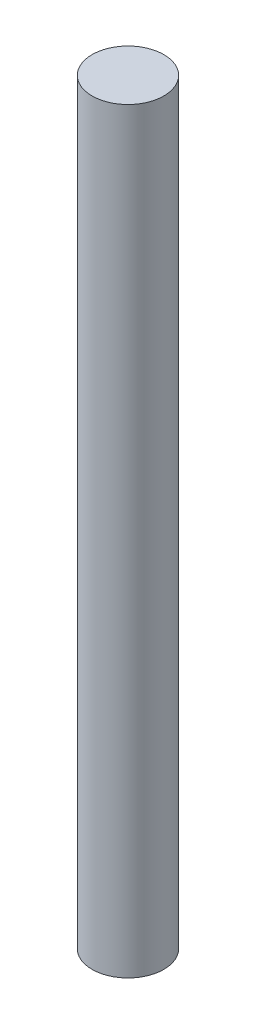
ISO-10303-21;
HEADER;
FILE_DESCRIPTION(('STEP AP214'),'2;1');
FILE_NAME('part.step','',(''),(''),'','','');
FILE_SCHEMA(('AUTOMOTIVE_DESIGN { 1 0 10303 214 1 1 1 1 }'));
ENDSEC;
DATA;
#1=APPLICATION_CONTEXT('core data for automotive mechanical design processes');
#2=APPLICATION_PROTOCOL_DEFINITION('international standard','automotive_design',2000,#1);
#3=PRODUCT_CONTEXT('',#1,'mechanical');
#4=PRODUCT('Part','Part','',(#3));
#5=PRODUCT_RELATED_PRODUCT_CATEGORY('part','',(#4));
#6=PRODUCT_DEFINITION_FORMATION('','',#4);
#7=PRODUCT_DEFINITION_CONTEXT('part definition',#1,'design');
#8=PRODUCT_DEFINITION('design','',#6,#7);
#9=PRODUCT_DEFINITION_SHAPE('','',#8);
#10=(LENGTH_UNIT() NAMED_UNIT(*) SI_UNIT(.MILLI.,.METRE.));
#11=(NAMED_UNIT(*) PLANE_ANGLE_UNIT() SI_UNIT($,.RADIAN.));
#12=(NAMED_UNIT(*) SI_UNIT($,.STERADIAN.) SOLID_ANGLE_UNIT());
#13=UNCERTAINTY_MEASURE_WITH_UNIT(LENGTH_MEASURE(1.E-05),#10,'distance_accuracy_value','');
#14=(GEOMETRIC_REPRESENTATION_CONTEXT(3) GLOBAL_UNCERTAINTY_ASSIGNED_CONTEXT((#13)) GLOBAL_UNIT_ASSIGNED_CONTEXT((#10,
#11,#12)) REPRESENTATION_CONTEXT('',''));
#15=CARTESIAN_POINT('',(0.,0.,0.));
#16=DIRECTION('',(0.,0.,1.));
#17=DIRECTION('',(1.,0.,0.));
#18=AXIS2_PLACEMENT_3D('',#15,#16,#17);
#19=CARTESIAN_POINT('',(0.,71.,0.));
#20=DIRECTION('',(0.,-1.,0.));
#21=DIRECTION('',(0.,0.,-1.));
#22=AXIS2_PLACEMENT_3D('',#19,#20,#21);
#23=CYLINDRICAL_SURFACE('',#22,3.3655);
#24=CARTESIAN_POINT('',(0.,71.,0.));
#25=DIRECTION('',(0.,1.,0.));
#26=DIRECTION('',(0.,0.,1.));
#27=AXIS2_PLACEMENT_3D('',#24,#25,#26);
#28=CIRCLE('',#27,3.3655);
#29=CARTESIAN_POINT('',(0.,71.,3.3655));
#30=VERTEX_POINT('',#29);
#31=EDGE_CURVE('E10',#30,#30,#28,.T.);
#32=ORIENTED_EDGE('',*,*,#31,.F.);
#33=EDGE_LOOP('',(#32));
#34=FACE_BOUND('',#33,.T.);
#35=CARTESIAN_POINT('',(0.,0.,0.));
#36=DIRECTION('',(0.,1.,0.));
#37=DIRECTION('',(0.,0.,1.));
#38=AXIS2_PLACEMENT_3D('',#35,#36,#37);
#39=CIRCLE('',#38,3.3655);
#40=CARTESIAN_POINT('',(0.,0.,3.3655));
#41=VERTEX_POINT('',#40);
#42=EDGE_CURVE('E37',#41,#41,#39,.T.);
#43=ORIENTED_EDGE('',*,*,#42,.T.);
#44=EDGE_LOOP('',(#43));
#45=FACE_BOUND('',#44,.T.);
#46=ADVANCED_FACE('F34',(#34,#45),#23,.T.);
#47=CARTESIAN_POINT('',(0.,71.,0.));
#48=DIRECTION('',(0.,1.,0.));
#49=DIRECTION('',(0.,0.,1.));
#50=AXIS2_PLACEMENT_3D('',#47,#48,#49);
#51=PLANE('',#50);
#52=ORIENTED_EDGE('',*,*,#31,.T.);
#53=EDGE_LOOP('',(#52));
#54=FACE_BOUND('',#53,.T.);
#55=ADVANCED_FACE('F49',(#54),#51,.T.);
#56=CARTESIAN_POINT('',(0.,0.,0.));
#57=DIRECTION('',(0.,1.,0.));
#58=DIRECTION('',(0.,0.,1.));
#59=AXIS2_PLACEMENT_3D('',#56,#57,#58);
#60=PLANE('',#59);
#61=ORIENTED_EDGE('',*,*,#42,.F.);
#62=EDGE_LOOP('',(#61));
#63=FACE_BOUND('',#62,.T.);
#64=ADVANCED_FACE('F47',(#63),#60,.F.);
#65=CLOSED_SHELL('',(#46,#55,#64));
#66=MANIFOLD_SOLID_BREP('B2',#65);
#67=ADVANCED_BREP_SHAPE_REPRESENTATION('',(#18,#66),#14);
#68=SHAPE_DEFINITION_REPRESENTATION(#9,#67);
ENDSEC;
END-ISO-10303-21;
